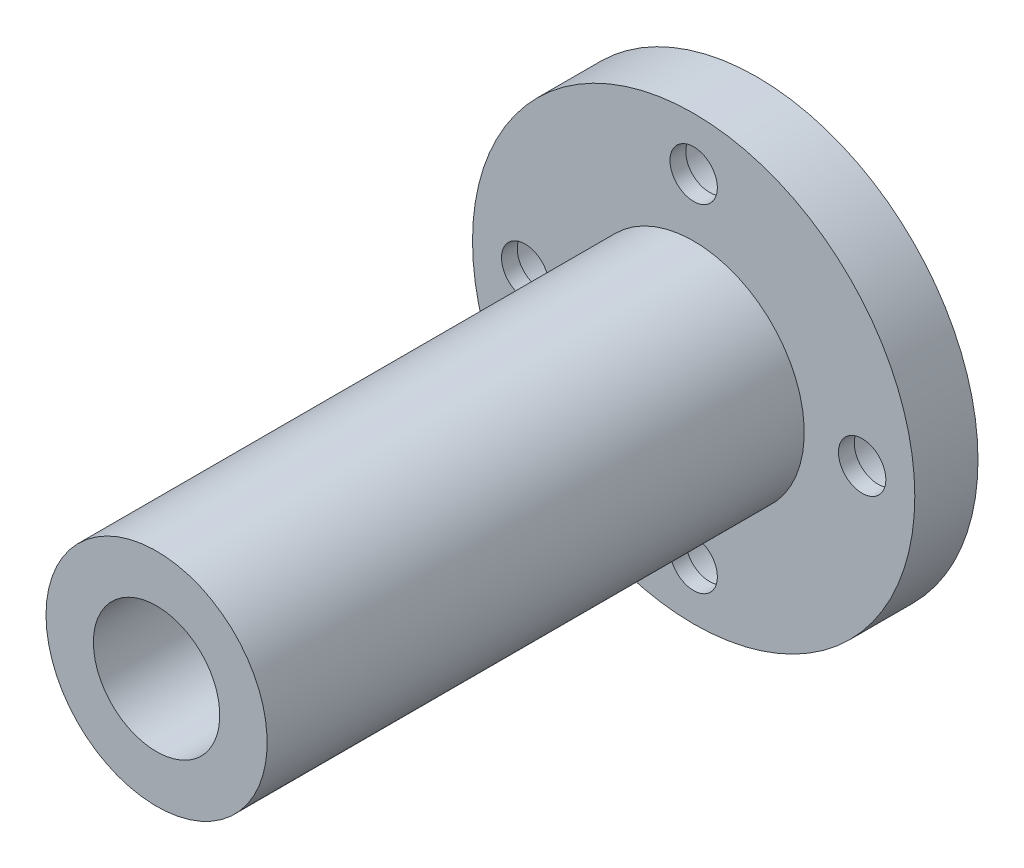
ISO-10303-21;
HEADER;
FILE_DESCRIPTION(('STEP AP214'),'2;1');
FILE_NAME('part.step','',(''),(''),'','','');
FILE_SCHEMA(('AUTOMOTIVE_DESIGN { 1 0 10303 214 1 1 1 1 }'));
ENDSEC;
DATA;
#1=APPLICATION_CONTEXT('core data for automotive mechanical design processes');
#2=APPLICATION_PROTOCOL_DEFINITION('international standard','automotive_design',2000,#1);
#3=PRODUCT_CONTEXT('',#1,'mechanical');
#4=PRODUCT('Part','Part','',(#3));
#5=PRODUCT_RELATED_PRODUCT_CATEGORY('part','',(#4));
#6=PRODUCT_DEFINITION_FORMATION('','',#4);
#7=PRODUCT_DEFINITION_CONTEXT('part definition',#1,'design');
#8=PRODUCT_DEFINITION('design','',#6,#7);
#9=PRODUCT_DEFINITION_SHAPE('','',#8);
#10=(LENGTH_UNIT() NAMED_UNIT(*) SI_UNIT(.MILLI.,.METRE.));
#11=(NAMED_UNIT(*) PLANE_ANGLE_UNIT() SI_UNIT($,.RADIAN.));
#12=(NAMED_UNIT(*) SI_UNIT($,.STERADIAN.) SOLID_ANGLE_UNIT());
#13=UNCERTAINTY_MEASURE_WITH_UNIT(LENGTH_MEASURE(1.E-05),#10,'distance_accuracy_value','');
#14=(GEOMETRIC_REPRESENTATION_CONTEXT(3) GLOBAL_UNCERTAINTY_ASSIGNED_CONTEXT((#13)) GLOBAL_UNIT_ASSIGNED_CONTEXT((#10,
#11,#12)) REPRESENTATION_CONTEXT('',''));
#15=CARTESIAN_POINT('',(0.,0.,0.));
#16=DIRECTION('',(0.,0.,1.));
#17=DIRECTION('',(1.,0.,0.));
#18=AXIS2_PLACEMENT_3D('',#15,#16,#17);
#19=CARTESIAN_POINT('',(16.,0.,0.));
#20=DIRECTION('',(0.,0.,1.));
#21=DIRECTION('',(1.,0.,0.));
#22=AXIS2_PLACEMENT_3D('',#19,#20,#21);
#23=CYLINDRICAL_SURFACE('',#22,2.25);
#24=CARTESIAN_POINT('',(16.,0.,6.));
#25=DIRECTION('',(0.,0.,1.));
#26=DIRECTION('',(1.,0.,0.));
#27=AXIS2_PLACEMENT_3D('',#24,#25,#26);
#28=CIRCLE('',#27,2.25);
#29=CARTESIAN_POINT('',(18.25,0.,6.));
#30=VERTEX_POINT('',#29);
#31=EDGE_CURVE('E88',#30,#30,#28,.T.);
#32=ORIENTED_EDGE('',*,*,#31,.T.);
#33=EDGE_LOOP('',(#32));
#34=FACE_BOUND('',#33,.T.);
#35=CARTESIAN_POINT('',(16.,0.,4.5));
#36=DIRECTION('',(0.,0.,-1.));
#37=DIRECTION('',(-1.,0.,0.));
#38=AXIS2_PLACEMENT_3D('',#35,#36,#37);
#39=CIRCLE('',#38,2.25);
#40=CARTESIAN_POINT('',(13.75,0.,4.5));
#41=VERTEX_POINT('',#40);
#42=EDGE_CURVE('E36',#41,#41,#39,.F.);
#43=ORIENTED_EDGE('',*,*,#42,.F.);
#44=EDGE_LOOP('',(#43));
#45=FACE_BOUND('',#44,.T.);
#46=ADVANCED_FACE('F32',(#34,#45),#23,.F.);
#47=CARTESIAN_POINT('',(0.,-16.,0.));
#48=DIRECTION('',(0.,0.,1.));
#49=DIRECTION('',(1.,0.,0.));
#50=AXIS2_PLACEMENT_3D('',#47,#48,#49);
#51=CYLINDRICAL_SURFACE('',#50,2.25);
#52=CARTESIAN_POINT('',(0.,-16.,6.));
#53=DIRECTION('',(0.,0.,1.));
#54=DIRECTION('',(1.,0.,0.));
#55=AXIS2_PLACEMENT_3D('',#52,#53,#54);
#56=CIRCLE('',#55,2.25);
#57=CARTESIAN_POINT('',(2.25,-16.,6.));
#58=VERTEX_POINT('',#57);
#59=EDGE_CURVE('E85',#58,#58,#56,.T.);
#60=ORIENTED_EDGE('',*,*,#59,.T.);
#61=EDGE_LOOP('',(#60));
#62=FACE_BOUND('',#61,.T.);
#63=CARTESIAN_POINT('',(0.,-16.,4.5));
#64=DIRECTION('',(0.,0.,-1.));
#65=DIRECTION('',(-1.,0.,0.));
#66=AXIS2_PLACEMENT_3D('',#63,#64,#65);
#67=CIRCLE('',#66,2.25);
#68=CARTESIAN_POINT('',(-2.25,-16.,4.5));
#69=VERTEX_POINT('',#68);
#70=EDGE_CURVE('E58',#69,#69,#67,.F.);
#71=ORIENTED_EDGE('',*,*,#70,.F.);
#72=EDGE_LOOP('',(#71));
#73=FACE_BOUND('',#72,.T.);
#74=ADVANCED_FACE('F120',(#62,#73),#51,.F.);
#75=CARTESIAN_POINT('',(-16.,0.,0.));
#76=DIRECTION('',(0.,0.,1.));
#77=DIRECTION('',(1.,0.,0.));
#78=AXIS2_PLACEMENT_3D('',#75,#76,#77);
#79=CYLINDRICAL_SURFACE('',#78,2.25);
#80=CARTESIAN_POINT('',(-16.,0.,6.));
#81=DIRECTION('',(0.,0.,1.));
#82=DIRECTION('',(1.,0.,0.));
#83=AXIS2_PLACEMENT_3D('',#80,#81,#82);
#84=CIRCLE('',#83,2.25);
#85=CARTESIAN_POINT('',(-13.75,0.,6.));
#86=VERTEX_POINT('',#85);
#87=EDGE_CURVE('E52',#86,#86,#84,.T.);
#88=ORIENTED_EDGE('',*,*,#87,.T.);
#89=EDGE_LOOP('',(#88));
#90=FACE_BOUND('',#89,.T.);
#91=CARTESIAN_POINT('',(-16.,0.,4.5));
#92=DIRECTION('',(0.,0.,-1.));
#93=DIRECTION('',(-1.,0.,0.));
#94=AXIS2_PLACEMENT_3D('',#91,#92,#93);
#95=CIRCLE('',#94,2.25);
#96=CARTESIAN_POINT('',(-18.25,0.,4.5));
#97=VERTEX_POINT('',#96);
#98=EDGE_CURVE('E54',#97,#97,#95,.F.);
#99=ORIENTED_EDGE('',*,*,#98,.F.);
#100=EDGE_LOOP('',(#99));
#101=FACE_BOUND('',#100,.T.);
#102=ADVANCED_FACE('F126',(#90,#101),#79,.F.);
#103=CARTESIAN_POINT('',(0.,16.,0.));
#104=DIRECTION('',(0.,0.,1.));
#105=DIRECTION('',(1.,0.,0.));
#106=AXIS2_PLACEMENT_3D('',#103,#104,#105);
#107=CYLINDRICAL_SURFACE('',#106,2.25);
#108=CARTESIAN_POINT('',(0.,16.,6.));
#109=DIRECTION('',(0.,0.,1.));
#110=DIRECTION('',(1.,0.,0.));
#111=AXIS2_PLACEMENT_3D('',#108,#109,#110);
#112=CIRCLE('',#111,2.25);
#113=CARTESIAN_POINT('',(2.25,16.,6.));
#114=VERTEX_POINT('',#113);
#115=EDGE_CURVE('E91',#114,#114,#112,.T.);
#116=ORIENTED_EDGE('',*,*,#115,.T.);
#117=EDGE_LOOP('',(#116));
#118=FACE_BOUND('',#117,.T.);
#119=CARTESIAN_POINT('',(0.,16.,4.5));
#120=DIRECTION('',(0.,0.,-1.));
#121=DIRECTION('',(-1.,0.,0.));
#122=AXIS2_PLACEMENT_3D('',#119,#120,#121);
#123=CIRCLE('',#122,2.25);
#124=CARTESIAN_POINT('',(-2.25,16.,4.5));
#125=VERTEX_POINT('',#124);
#126=EDGE_CURVE('E49',#125,#125,#123,.F.);
#127=ORIENTED_EDGE('',*,*,#126,.F.);
#128=EDGE_LOOP('',(#127));
#129=FACE_BOUND('',#128,.T.);
#130=ADVANCED_FACE('F132',(#118,#129),#107,.F.);
#131=CARTESIAN_POINT('',(0.,21.,0.));
#132=DIRECTION('',(0.,0.,-1.));
#133=DIRECTION('',(-1.,0.,0.));
#134=AXIS2_PLACEMENT_3D('',#131,#132,#133);
#135=PLANE('',#134);
#136=CARTESIAN_POINT('',(16.,0.,0.));
#137=DIRECTION('',(0.,0.,-1.));
#138=DIRECTION('',(-1.,0.,0.));
#139=AXIS2_PLACEMENT_3D('',#136,#137,#138);
#140=CIRCLE('',#139,3.75);
#141=CARTESIAN_POINT('',(12.25,0.,0.));
#142=VERTEX_POINT('',#141);
#143=EDGE_CURVE('E74',#142,#142,#140,.T.);
#144=ORIENTED_EDGE('',*,*,#143,.F.);
#145=EDGE_LOOP('',(#144));
#146=FACE_BOUND('',#145,.T.);
#147=CARTESIAN_POINT('',(0.,-16.,0.));
#148=DIRECTION('',(0.,0.,-1.));
#149=DIRECTION('',(-1.,0.,0.));
#150=AXIS2_PLACEMENT_3D('',#147,#148,#149);
#151=CIRCLE('',#150,3.75);
#152=CARTESIAN_POINT('',(-3.75,-16.,0.));
#153=VERTEX_POINT('',#152);
#154=EDGE_CURVE('E67',#153,#153,#151,.T.);
#155=ORIENTED_EDGE('',*,*,#154,.F.);
#156=EDGE_LOOP('',(#155));
#157=FACE_BOUND('',#156,.T.);
#158=CARTESIAN_POINT('',(-16.,0.,0.));
#159=DIRECTION('',(0.,0.,-1.));
#160=DIRECTION('',(-1.,0.,0.));
#161=AXIS2_PLACEMENT_3D('',#158,#159,#160);
#162=CIRCLE('',#161,3.75);
#163=CARTESIAN_POINT('',(-19.75,0.,0.));
#164=VERTEX_POINT('',#163);
#165=EDGE_CURVE('E60',#164,#164,#162,.T.);
#166=ORIENTED_EDGE('',*,*,#165,.F.);
#167=EDGE_LOOP('',(#166));
#168=FACE_BOUND('',#167,.T.);
#169=CARTESIAN_POINT('',(0.,16.,0.));
#170=DIRECTION('',(0.,0.,-1.));
#171=DIRECTION('',(-1.,0.,0.));
#172=AXIS2_PLACEMENT_3D('',#169,#170,#171);
#173=CIRCLE('',#172,3.75);
#174=CARTESIAN_POINT('',(-3.75,16.,0.));
#175=VERTEX_POINT('',#174);
#176=EDGE_CURVE('E56',#175,#175,#173,.T.);
#177=ORIENTED_EDGE('',*,*,#176,.F.);
#178=EDGE_LOOP('',(#177));
#179=FACE_BOUND('',#178,.T.);
#180=CARTESIAN_POINT('',(0.,0.,0.));
#181=DIRECTION('',(0.,0.,-1.));
#182=DIRECTION('',(-1.,0.,0.));
#183=AXIS2_PLACEMENT_3D('',#180,#181,#182);
#184=CIRCLE('',#183,21.);
#185=CARTESIAN_POINT('',(-21.,0.,0.));
#186=VERTEX_POINT('',#185);
#187=EDGE_CURVE('E94',#186,#186,#184,.T.);
#188=ORIENTED_EDGE('',*,*,#187,.T.);
#189=EDGE_LOOP('',(#188));
#190=FACE_BOUND('',#189,.T.);
#191=CARTESIAN_POINT('',(0.,0.,0.));
#192=DIRECTION('',(0.,0.,-1.));
#193=DIRECTION('',(-1.,0.,0.));
#194=AXIS2_PLACEMENT_3D('',#191,#192,#193);
#195=CIRCLE('',#194,6.);
#196=CARTESIAN_POINT('',(-6.,0.,0.));
#197=VERTEX_POINT('',#196);
#198=EDGE_CURVE('E10',#197,#197,#195,.T.);
#199=ORIENTED_EDGE('',*,*,#198,.F.);
#200=EDGE_LOOP('',(#199));
#201=FACE_BOUND('',#200,.T.);
#202=ADVANCED_FACE('F34',(#146,#157,#168,#179,#190,#201),#135,.T.);
#203=CARTESIAN_POINT('',(0.,0.,0.));
#204=DIRECTION('',(0.,0.,-1.));
#205=DIRECTION('',(-1.,0.,0.));
#206=AXIS2_PLACEMENT_3D('',#203,#204,#205);
#207=CYLINDRICAL_SURFACE('',#206,6.);
#208=ORIENTED_EDGE('',*,*,#198,.T.);
#209=EDGE_LOOP('',(#208));
#210=FACE_BOUND('',#209,.T.);
#211=CARTESIAN_POINT('',(0.,0.,57.));
#212=DIRECTION('',(0.,0.,-1.));
#213=DIRECTION('',(-1.,0.,0.));
#214=AXIS2_PLACEMENT_3D('',#211,#212,#213);
#215=CIRCLE('',#214,5.99999999999999);
#216=CARTESIAN_POINT('',(-5.99999999999999,0.,57.));
#217=VERTEX_POINT('',#216);
#218=EDGE_CURVE('E40',#217,#217,#215,.T.);
#219=ORIENTED_EDGE('',*,*,#218,.F.);
#220=EDGE_LOOP('',(#219));
#221=FACE_BOUND('',#220,.T.);
#222=ADVANCED_FACE('F110',(#210,#221),#207,.F.);
#223=CARTESIAN_POINT('',(0.,5.99999999999999,57.));
#224=DIRECTION('',(0.,0.,1.));
#225=DIRECTION('',(1.,0.,0.));
#226=AXIS2_PLACEMENT_3D('',#223,#224,#225);
#227=PLANE('',#226);
#228=ORIENTED_EDGE('',*,*,#218,.T.);
#229=EDGE_LOOP('',(#228));
#230=FACE_BOUND('',#229,.T.);
#231=CARTESIAN_POINT('',(0.,0.,57.));
#232=DIRECTION('',(0.,0.,-1.));
#233=DIRECTION('',(-1.,0.,0.));
#234=AXIS2_PLACEMENT_3D('',#231,#232,#233);
#235=CIRCLE('',#234,10.5);
#236=CARTESIAN_POINT('',(-10.5,0.,57.));
#237=VERTEX_POINT('',#236);
#238=EDGE_CURVE('E45',#237,#237,#235,.T.);
#239=ORIENTED_EDGE('',*,*,#238,.F.);
#240=EDGE_LOOP('',(#239));
#241=FACE_BOUND('',#240,.T.);
#242=ADVANCED_FACE('F108',(#230,#241),#227,.T.);
#243=CARTESIAN_POINT('',(0.,0.,0.));
#244=DIRECTION('',(0.,0.,-1.));
#245=DIRECTION('',(-1.,0.,0.));
#246=AXIS2_PLACEMENT_3D('',#243,#244,#245);
#247=CYLINDRICAL_SURFACE('',#246,10.5);
#248=ORIENTED_EDGE('',*,*,#238,.T.);
#249=EDGE_LOOP('',(#248));
#250=FACE_BOUND('',#249,.T.);
#251=CARTESIAN_POINT('',(0.,0.,6.));
#252=DIRECTION('',(0.,0.,-1.));
#253=DIRECTION('',(-1.,0.,0.));
#254=AXIS2_PLACEMENT_3D('',#251,#252,#253);
#255=CIRCLE('',#254,10.5);
#256=CARTESIAN_POINT('',(-10.5,0.,6.));
#257=VERTEX_POINT('',#256);
#258=EDGE_CURVE('E100',#257,#257,#255,.T.);
#259=ORIENTED_EDGE('',*,*,#258,.F.);
#260=EDGE_LOOP('',(#259));
#261=FACE_BOUND('',#260,.T.);
#262=ADVANCED_FACE('F105',(#250,#261),#247,.T.);
#263=CARTESIAN_POINT('',(0.,10.5,6.));
#264=DIRECTION('',(0.,0.,1.));
#265=DIRECTION('',(1.,0.,0.));
#266=AXIS2_PLACEMENT_3D('',#263,#264,#265);
#267=PLANE('',#266);
#268=ORIENTED_EDGE('',*,*,#87,.F.);
#269=EDGE_LOOP('',(#268));
#270=FACE_BOUND('',#269,.T.);
#271=ORIENTED_EDGE('',*,*,#59,.F.);
#272=EDGE_LOOP('',(#271));
#273=FACE_BOUND('',#272,.T.);
#274=ORIENTED_EDGE('',*,*,#31,.F.);
#275=EDGE_LOOP('',(#274));
#276=FACE_BOUND('',#275,.T.);
#277=ORIENTED_EDGE('',*,*,#115,.F.);
#278=EDGE_LOOP('',(#277));
#279=FACE_BOUND('',#278,.T.);
#280=ORIENTED_EDGE('',*,*,#258,.T.);
#281=EDGE_LOOP('',(#280));
#282=FACE_BOUND('',#281,.T.);
#283=CARTESIAN_POINT('',(0.,0.,6.));
#284=DIRECTION('',(0.,0.,-1.));
#285=DIRECTION('',(-1.,0.,0.));
#286=AXIS2_PLACEMENT_3D('',#283,#284,#285);
#287=CIRCLE('',#286,21.);
#288=CARTESIAN_POINT('',(-21.,0.,6.));
#289=VERTEX_POINT('',#288);
#290=EDGE_CURVE('E97',#289,#289,#287,.T.);
#291=ORIENTED_EDGE('',*,*,#290,.F.);
#292=EDGE_LOOP('',(#291));
#293=FACE_BOUND('',#292,.T.);
#294=ADVANCED_FACE('F117',(#270,#273,#276,#279,#282,#293),#267,.T.);
#295=CARTESIAN_POINT('',(0.,0.,0.));
#296=DIRECTION('',(0.,0.,-1.));
#297=DIRECTION('',(-1.,0.,0.));
#298=AXIS2_PLACEMENT_3D('',#295,#296,#297);
#299=CYLINDRICAL_SURFACE('',#298,21.);
#300=ORIENTED_EDGE('',*,*,#290,.T.);
#301=EDGE_LOOP('',(#300));
#302=FACE_BOUND('',#301,.T.);
#303=ORIENTED_EDGE('',*,*,#187,.F.);
#304=EDGE_LOOP('',(#303));
#305=FACE_BOUND('',#304,.T.);
#306=ADVANCED_FACE('F136',(#302,#305),#299,.T.);
#307=CARTESIAN_POINT('',(0.,16.,4.5));
#308=DIRECTION('',(0.,0.,-1.));
#309=DIRECTION('',(-1.,0.,0.));
#310=AXIS2_PLACEMENT_3D('',#307,#308,#309);
#311=PLANE('',#310);
#312=CARTESIAN_POINT('',(0.,16.,4.5));
#313=DIRECTION('',(0.,0.,-1.));
#314=DIRECTION('',(-1.,0.,0.));
#315=AXIS2_PLACEMENT_3D('',#312,#313,#314);
#316=CIRCLE('',#315,3.75);
#317=CARTESIAN_POINT('',(-3.75,16.,4.5));
#318=VERTEX_POINT('',#317);
#319=EDGE_CURVE('E53',#318,#318,#316,.T.);
#320=ORIENTED_EDGE('',*,*,#319,.T.);
#321=EDGE_LOOP('',(#320));
#322=FACE_BOUND('',#321,.T.);
#323=ORIENTED_EDGE('',*,*,#126,.T.);
#324=EDGE_LOOP('',(#323));
#325=FACE_BOUND('',#324,.T.);
#326=ADVANCED_FACE('F139',(#322,#325),#311,.T.);
#327=CARTESIAN_POINT('',(0.,16.,4.5));
#328=DIRECTION('',(0.,0.,-1.));
#329=DIRECTION('',(-1.,0.,0.));
#330=AXIS2_PLACEMENT_3D('',#327,#328,#329);
#331=CYLINDRICAL_SURFACE('',#330,3.75);
#332=ORIENTED_EDGE('',*,*,#319,.F.);
#333=EDGE_LOOP('',(#332));
#334=FACE_BOUND('',#333,.T.);
#335=ORIENTED_EDGE('',*,*,#176,.T.);
#336=EDGE_LOOP('',(#335));
#337=FACE_BOUND('',#336,.T.);
#338=ADVANCED_FACE('F173',(#334,#337),#331,.F.);
#339=CARTESIAN_POINT('',(-16.,0.,4.5));
#340=DIRECTION('',(0.,0.,-1.));
#341=DIRECTION('',(-1.,0.,0.));
#342=AXIS2_PLACEMENT_3D('',#339,#340,#341);
#343=PLANE('',#342);
#344=CARTESIAN_POINT('',(-16.,0.,4.5));
#345=DIRECTION('',(0.,0.,-1.));
#346=DIRECTION('',(-1.,0.,0.));
#347=AXIS2_PLACEMENT_3D('',#344,#345,#346);
#348=CIRCLE('',#347,3.75);
#349=CARTESIAN_POINT('',(-19.75,0.,4.5));
#350=VERTEX_POINT('',#349);
#351=EDGE_CURVE('E57',#350,#350,#348,.T.);
#352=ORIENTED_EDGE('',*,*,#351,.T.);
#353=EDGE_LOOP('',(#352));
#354=FACE_BOUND('',#353,.T.);
#355=ORIENTED_EDGE('',*,*,#98,.T.);
#356=EDGE_LOOP('',(#355));
#357=FACE_BOUND('',#356,.T.);
#358=ADVANCED_FACE('F175',(#354,#357),#343,.T.);
#359=CARTESIAN_POINT('',(-16.,0.,4.5));
#360=DIRECTION('',(0.,0.,-1.));
#361=DIRECTION('',(-1.,0.,0.));
#362=AXIS2_PLACEMENT_3D('',#359,#360,#361);
#363=CYLINDRICAL_SURFACE('',#362,3.75);
#364=ORIENTED_EDGE('',*,*,#351,.F.);
#365=EDGE_LOOP('',(#364));
#366=FACE_BOUND('',#365,.T.);
#367=ORIENTED_EDGE('',*,*,#165,.T.);
#368=EDGE_LOOP('',(#367));
#369=FACE_BOUND('',#368,.T.);
#370=ADVANCED_FACE('F182',(#366,#369),#363,.F.);
#371=CARTESIAN_POINT('',(0.,-16.,4.5));
#372=DIRECTION('',(0.,0.,-1.));
#373=DIRECTION('',(-1.,0.,0.));
#374=AXIS2_PLACEMENT_3D('',#371,#372,#373);
#375=PLANE('',#374);
#376=CARTESIAN_POINT('',(0.,-16.,4.5));
#377=DIRECTION('',(0.,0.,-1.));
#378=DIRECTION('',(-1.,0.,0.));
#379=AXIS2_PLACEMENT_3D('',#376,#377,#378);
#380=CIRCLE('',#379,3.75);
#381=CARTESIAN_POINT('',(-3.75,-16.,4.5));
#382=VERTEX_POINT('',#381);
#383=EDGE_CURVE('E61',#382,#382,#380,.T.);
#384=ORIENTED_EDGE('',*,*,#383,.T.);
#385=EDGE_LOOP('',(#384));
#386=FACE_BOUND('',#385,.T.);
#387=ORIENTED_EDGE('',*,*,#70,.T.);
#388=EDGE_LOOP('',(#387));
#389=FACE_BOUND('',#388,.T.);
#390=ADVANCED_FACE('F234',(#386,#389),#375,.T.);
#391=CARTESIAN_POINT('',(0.,-16.,4.5));
#392=DIRECTION('',(0.,0.,-1.));
#393=DIRECTION('',(-1.,0.,0.));
#394=AXIS2_PLACEMENT_3D('',#391,#392,#393);
#395=CYLINDRICAL_SURFACE('',#394,3.75);
#396=ORIENTED_EDGE('',*,*,#383,.F.);
#397=EDGE_LOOP('',(#396));
#398=FACE_BOUND('',#397,.T.);
#399=ORIENTED_EDGE('',*,*,#154,.T.);
#400=EDGE_LOOP('',(#399));
#401=FACE_BOUND('',#400,.T.);
#402=ADVANCED_FACE('F243',(#398,#401),#395,.F.);
#403=CARTESIAN_POINT('',(16.,0.,4.5));
#404=DIRECTION('',(0.,0.,-1.));
#405=DIRECTION('',(-1.,0.,0.));
#406=AXIS2_PLACEMENT_3D('',#403,#404,#405);
#407=PLANE('',#406);
#408=CARTESIAN_POINT('',(16.,0.,4.5));
#409=DIRECTION('',(0.,0.,-1.));
#410=DIRECTION('',(-1.,0.,0.));
#411=AXIS2_PLACEMENT_3D('',#408,#409,#410);
#412=CIRCLE('',#411,3.75);
#413=CARTESIAN_POINT('',(12.25,0.,4.5));
#414=VERTEX_POINT('',#413);
#415=EDGE_CURVE('E279',#414,#414,#412,.T.);
#416=ORIENTED_EDGE('',*,*,#415,.T.);
#417=EDGE_LOOP('',(#416));
#418=FACE_BOUND('',#417,.T.);
#419=ORIENTED_EDGE('',*,*,#42,.T.);
#420=EDGE_LOOP('',(#419));
#421=FACE_BOUND('',#420,.T.);
#422=ADVANCED_FACE('F252',(#418,#421),#407,.T.);
#423=CARTESIAN_POINT('',(16.,0.,4.5));
#424=DIRECTION('',(0.,0.,-1.));
#425=DIRECTION('',(-1.,0.,0.));
#426=AXIS2_PLACEMENT_3D('',#423,#424,#425);
#427=CYLINDRICAL_SURFACE('',#426,3.75);
#428=ORIENTED_EDGE('',*,*,#415,.F.);
#429=EDGE_LOOP('',(#428));
#430=FACE_BOUND('',#429,.T.);
#431=ORIENTED_EDGE('',*,*,#143,.T.);
#432=EDGE_LOOP('',(#431));
#433=FACE_BOUND('',#432,.T.);
#434=ADVANCED_FACE('F262',(#430,#433),#427,.F.);
#435=CLOSED_SHELL('',(#46,#74,#102,#130,#202,#222,#242,#262,#294,#306,#326,#338,#358,#370,#390,
#402,#422,#434));
#436=MANIFOLD_SOLID_BREP('B2',#435);
#437=ADVANCED_BREP_SHAPE_REPRESENTATION('',(#18,#436),#14);
#438=SHAPE_DEFINITION_REPRESENTATION(#9,#437);
ENDSEC;
END-ISO-10303-21;
